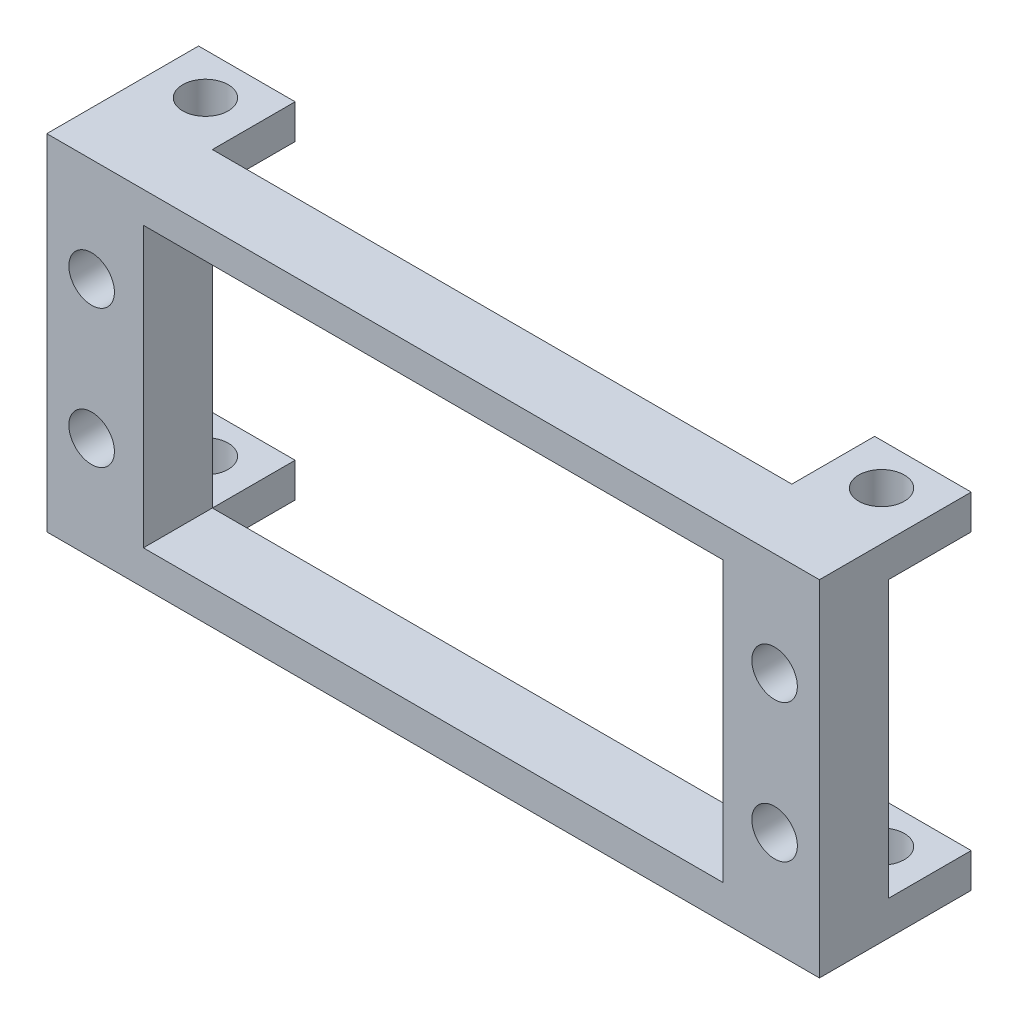
ISO-10303-21;
HEADER;
FILE_DESCRIPTION(('STEP AP214'),'2;1');
FILE_NAME('part.step','',(''),(''),'','','');
FILE_SCHEMA(('AUTOMOTIVE_DESIGN { 1 0 10303 214 1 1 1 1 }'));
ENDSEC;
DATA;
#1=APPLICATION_CONTEXT('core data for automotive mechanical design processes');
#2=APPLICATION_PROTOCOL_DEFINITION('international standard','automotive_design',2000,#1);
#3=PRODUCT_CONTEXT('',#1,'mechanical');
#4=PRODUCT('Part','Part','',(#3));
#5=PRODUCT_RELATED_PRODUCT_CATEGORY('part','',(#4));
#6=PRODUCT_DEFINITION_FORMATION('','',#4);
#7=PRODUCT_DEFINITION_CONTEXT('part definition',#1,'design');
#8=PRODUCT_DEFINITION('design','',#6,#7);
#9=PRODUCT_DEFINITION_SHAPE('','',#8);
#10=(LENGTH_UNIT() NAMED_UNIT(*) SI_UNIT(.MILLI.,.METRE.));
#11=(NAMED_UNIT(*) PLANE_ANGLE_UNIT() SI_UNIT($,.RADIAN.));
#12=(NAMED_UNIT(*) SI_UNIT($,.STERADIAN.) SOLID_ANGLE_UNIT());
#13=UNCERTAINTY_MEASURE_WITH_UNIT(LENGTH_MEASURE(1.E-05),#10,'distance_accuracy_value','');
#14=(GEOMETRIC_REPRESENTATION_CONTEXT(3) GLOBAL_UNCERTAINTY_ASSIGNED_CONTEXT((#13)) GLOBAL_UNIT_ASSIGNED_CONTEXT((#10,
#11,#12)) REPRESENTATION_CONTEXT('',''));
#15=CARTESIAN_POINT('',(0.,0.,0.));
#16=DIRECTION('',(0.,0.,1.));
#17=DIRECTION('',(1.,0.,0.));
#18=AXIS2_PLACEMENT_3D('',#15,#16,#17);
#19=CARTESIAN_POINT('',(-56.,25.,0.));
#20=DIRECTION('',(0.,0.,-1.));
#21=DIRECTION('',(-1.,0.,0.));
#22=AXIS2_PLACEMENT_3D('',#19,#20,#21);
#23=PLANE('',#22);
#24=DIRECTION('',(-1.,0.,0.));
#25=VECTOR('',#24,1.);
#26=CARTESIAN_POINT('',(-49.,22.75,0.));
#27=LINE('',#26,#25);
#28=CARTESIAN_POINT('',(-7.,22.75,0.));
#29=VERTEX_POINT('',#28);
#30=CARTESIAN_POINT('',(-49.,22.75,0.));
#31=VERTEX_POINT('',#30);
#32=EDGE_CURVE('E290',#29,#31,#27,.T.);
#33=ORIENTED_EDGE('',*,*,#32,.T.);
#34=DIRECTION('',(0.,-1.,0.));
#35=VECTOR('',#34,1.);
#36=CARTESIAN_POINT('',(-49.,25.,0.));
#37=LINE('',#36,#35);
#38=CARTESIAN_POINT('',(-49.,25.,0.));
#39=VERTEX_POINT('',#38);
#40=EDGE_CURVE('E56',#39,#31,#37,.T.);
#41=ORIENTED_EDGE('',*,*,#40,.F.);
#42=DIRECTION('',(-1.,0.,0.));
#43=VECTOR('',#42,1.);
#44=CARTESIAN_POINT('',(-56.,25.,0.));
#45=LINE('',#44,#43);
#46=CARTESIAN_POINT('',(-7.,25.,0.));
#47=VERTEX_POINT('',#46);
#48=EDGE_CURVE('E304',#47,#39,#45,.T.);
#49=ORIENTED_EDGE('',*,*,#48,.F.);
#50=DIRECTION('',(0.,1.,0.));
#51=VECTOR('',#50,1.);
#52=CARTESIAN_POINT('',(-7.,25.,0.));
#53=LINE('',#52,#51);
#54=EDGE_CURVE('E11',#29,#47,#53,.T.);
#55=ORIENTED_EDGE('',*,*,#54,.F.);
#56=EDGE_LOOP('',(#33,#41,#49,#55));
#57=FACE_BOUND('',#56,.T.);
#58=ADVANCED_FACE('F31',(#57),#23,.T.);
#59=CARTESIAN_POINT('',(-52.75,7.5,0.));
#60=DIRECTION('',(0.,0.,1.));
#61=DIRECTION('',(1.,0.,0.));
#62=AXIS2_PLACEMENT_3D('',#59,#60,#61);
#63=CIRCLE('',#62,1.64999999999999);
#64=CARTESIAN_POINT('',(-51.1,7.5,0.));
#65=VERTEX_POINT('',#64);
#66=EDGE_CURVE('E377',#65,#65,#63,.T.);
#67=ORIENTED_EDGE('',*,*,#66,.T.);
#68=EDGE_LOOP('',(#67));
#69=FACE_BOUND('',#68,.T.);
#70=CARTESIAN_POINT('',(-52.75,17.5,0.));
#71=DIRECTION('',(0.,0.,1.));
#72=DIRECTION('',(1.,0.,0.));
#73=AXIS2_PLACEMENT_3D('',#70,#71,#72);
#74=CIRCLE('',#73,1.64999999999999);
#75=CARTESIAN_POINT('',(-51.1,17.5,0.));
#76=VERTEX_POINT('',#75);
#77=EDGE_CURVE('E283',#76,#76,#74,.T.);
#78=ORIENTED_EDGE('',*,*,#77,.T.);
#79=EDGE_LOOP('',(#78));
#80=FACE_BOUND('',#79,.T.);
#81=DIRECTION('',(0.,-1.,0.));
#82=VECTOR('',#81,1.);
#83=CARTESIAN_POINT('',(-56.,0.,0.));
#84=LINE('',#83,#82);
#85=CARTESIAN_POINT('',(-56.,22.5,0.));
#86=VERTEX_POINT('',#85);
#87=CARTESIAN_POINT('',(-56.,2.5,0.));
#88=VERTEX_POINT('',#87);
#89=EDGE_CURVE('E48',#86,#88,#84,.T.);
#90=ORIENTED_EDGE('',*,*,#89,.F.);
#91=DIRECTION('',(-1.,0.,0.));
#92=VECTOR('',#91,1.);
#93=CARTESIAN_POINT('',(-56.,22.5,0.));
#94=LINE('',#93,#92);
#95=CARTESIAN_POINT('',(-49.,22.5,0.));
#96=VERTEX_POINT('',#95);
#97=EDGE_CURVE('E193',#96,#86,#94,.T.);
#98=ORIENTED_EDGE('',*,*,#97,.F.);
#99=DIRECTION('',(0.,-1.,0.));
#100=VECTOR('',#99,1.);
#101=CARTESIAN_POINT('',(-49.,2.49999999999999,0.));
#102=LINE('',#101,#100);
#103=CARTESIAN_POINT('',(-49.,2.5,0.));
#104=VERTEX_POINT('',#103);
#105=EDGE_CURVE('E292',#96,#104,#102,.T.);
#106=ORIENTED_EDGE('',*,*,#105,.T.);
#107=DIRECTION('',(1.,0.,0.));
#108=VECTOR('',#107,1.);
#109=CARTESIAN_POINT('',(-56.,2.5,0.));
#110=LINE('',#109,#108);
#111=EDGE_CURVE('E209',#88,#104,#110,.T.);
#112=ORIENTED_EDGE('',*,*,#111,.F.);
#113=EDGE_LOOP('',(#90,#98,#106,#112));
#114=FACE_BOUND('',#113,.T.);
#115=ADVANCED_FACE('F385',(#69,#80,#114),#23,.T.);
#116=DIRECTION('',(1.,0.,0.));
#117=VECTOR('',#116,1.);
#118=CARTESIAN_POINT('',(-56.,0.,0.));
#119=LINE('',#118,#117);
#120=CARTESIAN_POINT('',(-49.,0.,0.));
#121=VERTEX_POINT('',#120);
#122=CARTESIAN_POINT('',(-7.,0.,0.));
#123=VERTEX_POINT('',#122);
#124=EDGE_CURVE('E305',#121,#123,#119,.T.);
#125=ORIENTED_EDGE('',*,*,#124,.F.);
#126=DIRECTION('',(0.,-1.,0.));
#127=VECTOR('',#126,1.);
#128=CARTESIAN_POINT('',(-49.,0.,0.));
#129=LINE('',#128,#127);
#130=EDGE_CURVE('E214',#104,#121,#129,.T.);
#131=ORIENTED_EDGE('',*,*,#130,.F.);
#132=DIRECTION('',(1.,0.,0.));
#133=VECTOR('',#132,1.);
#134=CARTESIAN_POINT('',(-7.,2.5,0.));
#135=LINE('',#134,#133);
#136=CARTESIAN_POINT('',(-7.,2.5,0.));
#137=VERTEX_POINT('',#136);
#138=EDGE_CURVE('E317',#104,#137,#135,.T.);
#139=ORIENTED_EDGE('',*,*,#138,.T.);
#140=DIRECTION('',(0.,1.,0.));
#141=VECTOR('',#140,1.);
#142=CARTESIAN_POINT('',(-7.,0.,0.));
#143=LINE('',#142,#141);
#144=EDGE_CURVE('E233',#123,#137,#143,.T.);
#145=ORIENTED_EDGE('',*,*,#144,.F.);
#146=EDGE_LOOP('',(#125,#131,#139,#145));
#147=FACE_BOUND('',#146,.T.);
#148=ADVANCED_FACE('F351',(#147),#23,.T.);
#149=CARTESIAN_POINT('',(-3.25,17.5,0.));
#150=DIRECTION('',(0.,0.,1.));
#151=DIRECTION('',(1.,0.,0.));
#152=AXIS2_PLACEMENT_3D('',#149,#150,#151);
#153=CIRCLE('',#152,1.65);
#154=CARTESIAN_POINT('',(-1.6,17.5,0.));
#155=VERTEX_POINT('',#154);
#156=EDGE_CURVE('E365',#155,#155,#153,.T.);
#157=ORIENTED_EDGE('',*,*,#156,.T.);
#158=EDGE_LOOP('',(#157));
#159=FACE_BOUND('',#158,.T.);
#160=CARTESIAN_POINT('',(-3.25,7.5,0.));
#161=DIRECTION('',(0.,0.,1.));
#162=DIRECTION('',(1.,0.,0.));
#163=AXIS2_PLACEMENT_3D('',#160,#161,#162);
#164=CIRCLE('',#163,1.65);
#165=CARTESIAN_POINT('',(-1.6,7.5,0.));
#166=VERTEX_POINT('',#165);
#167=EDGE_CURVE('E371',#166,#166,#164,.T.);
#168=ORIENTED_EDGE('',*,*,#167,.T.);
#169=EDGE_LOOP('',(#168));
#170=FACE_BOUND('',#169,.T.);
#171=DIRECTION('',(0.,1.,0.));
#172=VECTOR('',#171,1.);
#173=CARTESIAN_POINT('',(0.,0.,0.));
#174=LINE('',#173,#172);
#175=CARTESIAN_POINT('',(0.,2.5,0.));
#176=VERTEX_POINT('',#175);
#177=CARTESIAN_POINT('',(0.,22.5,0.));
#178=VERTEX_POINT('',#177);
#179=EDGE_CURVE('E302',#176,#178,#174,.T.);
#180=ORIENTED_EDGE('',*,*,#179,.F.);
#181=DIRECTION('',(1.,0.,0.));
#182=VECTOR('',#181,1.);
#183=CARTESIAN_POINT('',(0.,2.5,0.));
#184=LINE('',#183,#182);
#185=EDGE_CURVE('E238',#137,#176,#184,.T.);
#186=ORIENTED_EDGE('',*,*,#185,.F.);
#187=DIRECTION('',(0.,1.,0.));
#188=VECTOR('',#187,1.);
#189=CARTESIAN_POINT('',(-7.,22.75,0.));
#190=LINE('',#189,#188);
#191=CARTESIAN_POINT('',(-7.,22.5,0.));
#192=VERTEX_POINT('',#191);
#193=EDGE_CURVE('E313',#137,#192,#190,.T.);
#194=ORIENTED_EDGE('',*,*,#193,.T.);
#195=DIRECTION('',(-1.,0.,0.));
#196=VECTOR('',#195,1.);
#197=CARTESIAN_POINT('',(0.,22.5,0.));
#198=LINE('',#197,#196);
#199=EDGE_CURVE('E255',#178,#192,#198,.T.);
#200=ORIENTED_EDGE('',*,*,#199,.F.);
#201=EDGE_LOOP('',(#180,#186,#194,#200));
#202=FACE_BOUND('',#201,.T.);
#203=ADVANCED_FACE('F398',(#159,#170,#202),#23,.T.);
#204=CARTESIAN_POINT('',(-56.,25.,5.));
#205=DIRECTION('',(0.,0.,-1.));
#206=DIRECTION('',(-1.,0.,0.));
#207=AXIS2_PLACEMENT_3D('',#204,#205,#206);
#208=PLANE('',#207);
#209=CARTESIAN_POINT('',(-52.75,17.5,5.));
#210=DIRECTION('',(0.,0.,1.));
#211=DIRECTION('',(1.,0.,0.));
#212=AXIS2_PLACEMENT_3D('',#209,#210,#211);
#213=CIRCLE('',#212,1.64999999999999);
#214=CARTESIAN_POINT('',(-51.1,17.5,5.));
#215=VERTEX_POINT('',#214);
#216=EDGE_CURVE('E380',#215,#215,#213,.T.);
#217=ORIENTED_EDGE('',*,*,#216,.F.);
#218=EDGE_LOOP('',(#217));
#219=FACE_BOUND('',#218,.T.);
#220=CARTESIAN_POINT('',(-52.75,7.5,5.));
#221=DIRECTION('',(0.,0.,1.));
#222=DIRECTION('',(1.,0.,0.));
#223=AXIS2_PLACEMENT_3D('',#220,#221,#222);
#224=CIRCLE('',#223,1.64999999999999);
#225=CARTESIAN_POINT('',(-51.1,7.5,5.));
#226=VERTEX_POINT('',#225);
#227=EDGE_CURVE('E374',#226,#226,#224,.T.);
#228=ORIENTED_EDGE('',*,*,#227,.F.);
#229=EDGE_LOOP('',(#228));
#230=FACE_BOUND('',#229,.T.);
#231=CARTESIAN_POINT('',(-3.25,7.5,5.));
#232=DIRECTION('',(0.,0.,1.));
#233=DIRECTION('',(1.,0.,0.));
#234=AXIS2_PLACEMENT_3D('',#231,#232,#233);
#235=CIRCLE('',#234,1.64999999999999);
#236=CARTESIAN_POINT('',(-1.60000000000001,7.5,5.));
#237=VERTEX_POINT('',#236);
#238=EDGE_CURVE('E368',#237,#237,#235,.T.);
#239=ORIENTED_EDGE('',*,*,#238,.F.);
#240=EDGE_LOOP('',(#239));
#241=FACE_BOUND('',#240,.T.);
#242=CARTESIAN_POINT('',(-3.25,17.5,5.));
#243=DIRECTION('',(0.,0.,1.));
#244=DIRECTION('',(1.,0.,0.));
#245=AXIS2_PLACEMENT_3D('',#242,#243,#244);
#246=CIRCLE('',#245,1.64999999999999);
#247=CARTESIAN_POINT('',(-1.60000000000001,17.5,5.));
#248=VERTEX_POINT('',#247);
#249=EDGE_CURVE('E293',#248,#248,#246,.T.);
#250=ORIENTED_EDGE('',*,*,#249,.F.);
#251=EDGE_LOOP('',(#250));
#252=FACE_BOUND('',#251,.T.);
#253=DIRECTION('',(0.,-1.,0.));
#254=VECTOR('',#253,1.);
#255=CARTESIAN_POINT('',(-56.,0.,5.));
#256=LINE('',#255,#254);
#257=CARTESIAN_POINT('',(-56.,25.,5.));
#258=VERTEX_POINT('',#257);
#259=CARTESIAN_POINT('',(-56.,0.,5.));
#260=VERTEX_POINT('',#259);
#261=EDGE_CURVE('E174',#258,#260,#256,.T.);
#262=ORIENTED_EDGE('',*,*,#261,.T.);
#263=DIRECTION('',(1.,0.,0.));
#264=VECTOR('',#263,1.);
#265=CARTESIAN_POINT('',(-56.,0.,5.));
#266=LINE('',#265,#264);
#267=CARTESIAN_POINT('',(0.,0.,5.));
#268=VERTEX_POINT('',#267);
#269=EDGE_CURVE('E331',#260,#268,#266,.T.);
#270=ORIENTED_EDGE('',*,*,#269,.T.);
#271=DIRECTION('',(0.,1.,0.));
#272=VECTOR('',#271,1.);
#273=CARTESIAN_POINT('',(0.,0.,5.));
#274=LINE('',#273,#272);
#275=CARTESIAN_POINT('',(0.,25.,5.));
#276=VERTEX_POINT('',#275);
#277=EDGE_CURVE('E333',#268,#276,#274,.T.);
#278=ORIENTED_EDGE('',*,*,#277,.T.);
#279=DIRECTION('',(-1.,0.,0.));
#280=VECTOR('',#279,1.);
#281=CARTESIAN_POINT('',(-56.,25.,5.));
#282=LINE('',#281,#280);
#283=EDGE_CURVE('E178',#276,#258,#282,.T.);
#284=ORIENTED_EDGE('',*,*,#283,.T.);
#285=EDGE_LOOP('',(#262,#270,#278,#284));
#286=FACE_BOUND('',#285,.T.);
#287=DIRECTION('',(-1.,0.,0.));
#288=VECTOR('',#287,1.);
#289=CARTESIAN_POINT('',(-49.,22.75,5.));
#290=LINE('',#289,#288);
#291=CARTESIAN_POINT('',(-7.,22.75,5.));
#292=VERTEX_POINT('',#291);
#293=CARTESIAN_POINT('',(-49.,22.75,5.));
#294=VERTEX_POINT('',#293);
#295=EDGE_CURVE('E316',#292,#294,#290,.T.);
#296=ORIENTED_EDGE('',*,*,#295,.F.);
#297=DIRECTION('',(0.,1.,0.));
#298=VECTOR('',#297,1.);
#299=CARTESIAN_POINT('',(-7.,22.75,5.));
#300=LINE('',#299,#298);
#301=CARTESIAN_POINT('',(-7.,2.5,5.));
#302=VERTEX_POINT('',#301);
#303=EDGE_CURVE('E300',#302,#292,#300,.T.);
#304=ORIENTED_EDGE('',*,*,#303,.F.);
#305=DIRECTION('',(1.,0.,0.));
#306=VECTOR('',#305,1.);
#307=CARTESIAN_POINT('',(-7.,2.5,5.));
#308=LINE('',#307,#306);
#309=CARTESIAN_POINT('',(-49.,2.49999999999999,5.));
#310=VERTEX_POINT('',#309);
#311=EDGE_CURVE('E357',#310,#302,#308,.T.);
#312=ORIENTED_EDGE('',*,*,#311,.F.);
#313=DIRECTION('',(0.,-1.,0.));
#314=VECTOR('',#313,1.);
#315=CARTESIAN_POINT('',(-49.,2.49999999999999,5.));
#316=LINE('',#315,#314);
#317=EDGE_CURVE('E360',#294,#310,#316,.T.);
#318=ORIENTED_EDGE('',*,*,#317,.F.);
#319=EDGE_LOOP('',(#296,#304,#312,#318));
#320=FACE_BOUND('',#319,.T.);
#321=ADVANCED_FACE('F395',(#219,#230,#241,#252,#286,#320),#208,.F.);
#322=CARTESIAN_POINT('',(-56.,0.,5.));
#323=DIRECTION('',(1.,0.,0.));
#324=DIRECTION('',(0.,0.,-1.));
#325=AXIS2_PLACEMENT_3D('',#322,#323,#324);
#326=PLANE('',#325);
#327=DIRECTION('',(0.,0.,-1.));
#328=VECTOR('',#327,1.);
#329=CARTESIAN_POINT('',(-56.,25.,5.));
#330=LINE('',#329,#328);
#331=CARTESIAN_POINT('',(-56.,25.,-6.));
#332=VERTEX_POINT('',#331);
#333=EDGE_CURVE('E167',#258,#332,#330,.T.);
#334=ORIENTED_EDGE('',*,*,#333,.T.);
#335=DIRECTION('',(0.,1.,0.));
#336=VECTOR('',#335,1.);
#337=CARTESIAN_POINT('',(-56.,25.,-6.));
#338=LINE('',#337,#336);
#339=CARTESIAN_POINT('',(-56.,22.5,-6.));
#340=VERTEX_POINT('',#339);
#341=EDGE_CURVE('E171',#340,#332,#338,.T.);
#342=ORIENTED_EDGE('',*,*,#341,.F.);
#343=DIRECTION('',(0.,0.,1.));
#344=VECTOR('',#343,1.);
#345=CARTESIAN_POINT('',(-56.,22.5,-6.));
#346=LINE('',#345,#344);
#347=EDGE_CURVE('E202',#340,#86,#346,.T.);
#348=ORIENTED_EDGE('',*,*,#347,.T.);
#349=ORIENTED_EDGE('',*,*,#89,.T.);
#350=DIRECTION('',(0.,0.,1.));
#351=VECTOR('',#350,1.);
#352=CARTESIAN_POINT('',(-56.,2.5,-6.));
#353=LINE('',#352,#351);
#354=CARTESIAN_POINT('',(-56.,2.5,-6.));
#355=VERTEX_POINT('',#354);
#356=EDGE_CURVE('E230',#355,#88,#353,.T.);
#357=ORIENTED_EDGE('',*,*,#356,.F.);
#358=DIRECTION('',(0.,1.,0.));
#359=VECTOR('',#358,1.);
#360=CARTESIAN_POINT('',(-56.,0.,-6.));
#361=LINE('',#360,#359);
#362=CARTESIAN_POINT('',(-56.,0.,-6.));
#363=VERTEX_POINT('',#362);
#364=EDGE_CURVE('E210',#363,#355,#361,.T.);
#365=ORIENTED_EDGE('',*,*,#364,.F.);
#366=DIRECTION('',(0.,0.,-1.));
#367=VECTOR('',#366,1.);
#368=CARTESIAN_POINT('',(-56.,0.,5.));
#369=LINE('',#368,#367);
#370=EDGE_CURVE('E40',#260,#363,#369,.T.);
#371=ORIENTED_EDGE('',*,*,#370,.F.);
#372=ORIENTED_EDGE('',*,*,#261,.F.);
#373=EDGE_LOOP('',(#334,#342,#348,#349,#357,#365,#371,#372));
#374=FACE_BOUND('',#373,.T.);
#375=ADVANCED_FACE('F33',(#374),#326,.F.);
#376=CARTESIAN_POINT('',(-56.,0.,5.));
#377=DIRECTION('',(0.,1.,0.));
#378=DIRECTION('',(0.,0.,1.));
#379=AXIS2_PLACEMENT_3D('',#376,#377,#378);
#380=PLANE('',#379);
#381=CARTESIAN_POINT('',(-3.5,0.,-3.));
#382=DIRECTION('',(0.,-1.,0.));
#383=DIRECTION('',(0.,0.,-1.));
#384=AXIS2_PLACEMENT_3D('',#381,#382,#383);
#385=CIRCLE('',#384,1.64999999999999);
#386=CARTESIAN_POINT('',(-3.5,0.,-4.64999999999999));
#387=VERTEX_POINT('',#386);
#388=EDGE_CURVE('E444',#387,#387,#385,.T.);
#389=ORIENTED_EDGE('',*,*,#388,.F.);
#390=EDGE_LOOP('',(#389));
#391=FACE_BOUND('',#390,.T.);
#392=CARTESIAN_POINT('',(-52.5,0.,-3.));
#393=DIRECTION('',(0.,-1.,0.));
#394=DIRECTION('',(0.,0.,-1.));
#395=AXIS2_PLACEMENT_3D('',#392,#393,#394);
#396=CIRCLE('',#395,1.64999999999999);
#397=CARTESIAN_POINT('',(-52.5,0.,-4.64999999999999));
#398=VERTEX_POINT('',#397);
#399=EDGE_CURVE('E447',#398,#398,#396,.T.);
#400=ORIENTED_EDGE('',*,*,#399,.F.);
#401=EDGE_LOOP('',(#400));
#402=FACE_BOUND('',#401,.T.);
#403=ORIENTED_EDGE('',*,*,#370,.T.);
#404=DIRECTION('',(-1.,0.,0.));
#405=VECTOR('',#404,1.);
#406=CARTESIAN_POINT('',(-56.,0.,-6.));
#407=LINE('',#406,#405);
#408=CARTESIAN_POINT('',(-49.,0.,-6.));
#409=VERTEX_POINT('',#408);
#410=EDGE_CURVE('E218',#409,#363,#407,.T.);
#411=ORIENTED_EDGE('',*,*,#410,.F.);
#412=DIRECTION('',(0.,0.,1.));
#413=VECTOR('',#412,1.);
#414=CARTESIAN_POINT('',(-49.,0.,-6.));
#415=LINE('',#414,#413);
#416=EDGE_CURVE('E221',#409,#121,#415,.T.);
#417=ORIENTED_EDGE('',*,*,#416,.T.);
#418=ORIENTED_EDGE('',*,*,#124,.T.);
#419=DIRECTION('',(0.,0.,1.));
#420=VECTOR('',#419,1.);
#421=CARTESIAN_POINT('',(-7.,0.,-6.));
#422=LINE('',#421,#420);
#423=CARTESIAN_POINT('',(-7.,0.,-6.));
#424=VERTEX_POINT('',#423);
#425=EDGE_CURVE('E252',#424,#123,#422,.T.);
#426=ORIENTED_EDGE('',*,*,#425,.F.);
#427=DIRECTION('',(-1.,0.,0.));
#428=VECTOR('',#427,1.);
#429=CARTESIAN_POINT('',(0.,0.,-6.));
#430=LINE('',#429,#428);
#431=CARTESIAN_POINT('',(0.,0.,-6.));
#432=VERTEX_POINT('',#431);
#433=EDGE_CURVE('E237',#432,#424,#430,.T.);
#434=ORIENTED_EDGE('',*,*,#433,.F.);
#435=DIRECTION('',(0.,0.,-1.));
#436=VECTOR('',#435,1.);
#437=CARTESIAN_POINT('',(0.,0.,5.));
#438=LINE('',#437,#436);
#439=EDGE_CURVE('E737',#268,#432,#438,.T.);
#440=ORIENTED_EDGE('',*,*,#439,.F.);
#441=ORIENTED_EDGE('',*,*,#269,.F.);
#442=EDGE_LOOP('',(#403,#411,#417,#418,#426,#434,#440,#441));
#443=FACE_BOUND('',#442,.T.);
#444=ADVANCED_FACE('F339',(#391,#402,#443),#380,.F.);
#445=CARTESIAN_POINT('',(0.,0.,5.));
#446=DIRECTION('',(-1.,0.,0.));
#447=DIRECTION('',(0.,0.,1.));
#448=AXIS2_PLACEMENT_3D('',#445,#446,#447);
#449=PLANE('',#448);
#450=ORIENTED_EDGE('',*,*,#439,.T.);
#451=DIRECTION('',(0.,-1.,0.));
#452=VECTOR('',#451,1.);
#453=CARTESIAN_POINT('',(0.,0.,-6.));
#454=LINE('',#453,#452);
#455=CARTESIAN_POINT('',(0.,2.5,-6.));
#456=VERTEX_POINT('',#455);
#457=EDGE_CURVE('E234',#456,#432,#454,.T.);
#458=ORIENTED_EDGE('',*,*,#457,.F.);
#459=DIRECTION('',(0.,0.,1.));
#460=VECTOR('',#459,1.);
#461=CARTESIAN_POINT('',(0.,2.5,-6.));
#462=LINE('',#461,#460);
#463=EDGE_CURVE('E244',#456,#176,#462,.T.);
#464=ORIENTED_EDGE('',*,*,#463,.T.);
#465=ORIENTED_EDGE('',*,*,#179,.T.);
#466=DIRECTION('',(0.,0.,1.));
#467=VECTOR('',#466,1.);
#468=CARTESIAN_POINT('',(0.,22.5,-6.));
#469=LINE('',#468,#467);
#470=CARTESIAN_POINT('',(0.,22.5,-6.));
#471=VERTEX_POINT('',#470);
#472=EDGE_CURVE('E278',#471,#178,#469,.T.);
#473=ORIENTED_EDGE('',*,*,#472,.F.);
#474=DIRECTION('',(0.,-1.,0.));
#475=VECTOR('',#474,1.);
#476=CARTESIAN_POINT('',(0.,25.,-6.));
#477=LINE('',#476,#475);
#478=CARTESIAN_POINT('',(0.,25.,-6.));
#479=VERTEX_POINT('',#478);
#480=EDGE_CURVE('E256',#479,#471,#477,.T.);
#481=ORIENTED_EDGE('',*,*,#480,.F.);
#482=DIRECTION('',(0.,0.,-1.));
#483=VECTOR('',#482,1.);
#484=CARTESIAN_POINT('',(0.,25.,5.));
#485=LINE('',#484,#483);
#486=EDGE_CURVE('E177',#276,#479,#485,.T.);
#487=ORIENTED_EDGE('',*,*,#486,.F.);
#488=ORIENTED_EDGE('',*,*,#277,.F.);
#489=EDGE_LOOP('',(#450,#458,#464,#465,#473,#481,#487,#488));
#490=FACE_BOUND('',#489,.T.);
#491=ADVANCED_FACE('F432',(#490),#449,.F.);
#492=CARTESIAN_POINT('',(-56.,25.,5.));
#493=DIRECTION('',(0.,-1.,0.));
#494=DIRECTION('',(0.,0.,-1.));
#495=AXIS2_PLACEMENT_3D('',#492,#493,#494);
#496=PLANE('',#495);
#497=CARTESIAN_POINT('',(-3.5,25.,-3.));
#498=DIRECTION('',(0.,1.,0.));
#499=DIRECTION('',(0.,0.,1.));
#500=AXIS2_PLACEMENT_3D('',#497,#498,#499);
#501=CIRCLE('',#500,1.64999999999999);
#502=CARTESIAN_POINT('',(-3.5,25.,-1.35000000000001));
#503=VERTEX_POINT('',#502);
#504=EDGE_CURVE('E462',#503,#503,#501,.T.);
#505=ORIENTED_EDGE('',*,*,#504,.F.);
#506=EDGE_LOOP('',(#505));
#507=FACE_BOUND('',#506,.T.);
#508=CARTESIAN_POINT('',(-52.5,25.,-3.));
#509=DIRECTION('',(0.,1.,0.));
#510=DIRECTION('',(0.,0.,1.));
#511=AXIS2_PLACEMENT_3D('',#508,#509,#510);
#512=CIRCLE('',#511,1.64999999999999);
#513=CARTESIAN_POINT('',(-52.5,25.,-1.35000000000001));
#514=VERTEX_POINT('',#513);
#515=EDGE_CURVE('E456',#514,#514,#512,.T.);
#516=ORIENTED_EDGE('',*,*,#515,.F.);
#517=EDGE_LOOP('',(#516));
#518=FACE_BOUND('',#517,.T.);
#519=ORIENTED_EDGE('',*,*,#486,.T.);
#520=DIRECTION('',(1.,0.,0.));
#521=VECTOR('',#520,1.);
#522=CARTESIAN_POINT('',(0.,25.,-6.));
#523=LINE('',#522,#521);
#524=CARTESIAN_POINT('',(-7.,25.,-6.));
#525=VERTEX_POINT('',#524);
#526=EDGE_CURVE('E263',#525,#479,#523,.T.);
#527=ORIENTED_EDGE('',*,*,#526,.F.);
#528=DIRECTION('',(0.,0.,1.));
#529=VECTOR('',#528,1.);
#530=CARTESIAN_POINT('',(-7.,25.,-6.));
#531=LINE('',#530,#529);
#532=EDGE_CURVE('E266',#525,#47,#531,.T.);
#533=ORIENTED_EDGE('',*,*,#532,.T.);
#534=ORIENTED_EDGE('',*,*,#48,.T.);
#535=DIRECTION('',(0.,0.,1.));
#536=VECTOR('',#535,1.);
#537=CARTESIAN_POINT('',(-49.,25.,-6.));
#538=LINE('',#537,#536);
#539=CARTESIAN_POINT('',(-49.,25.,-6.));
#540=VERTEX_POINT('',#539);
#541=EDGE_CURVE('E184',#540,#39,#538,.T.);
#542=ORIENTED_EDGE('',*,*,#541,.F.);
#543=DIRECTION('',(1.,0.,0.));
#544=VECTOR('',#543,1.);
#545=CARTESIAN_POINT('',(-56.,25.,-6.));
#546=LINE('',#545,#544);
#547=EDGE_CURVE('E181',#332,#540,#546,.T.);
#548=ORIENTED_EDGE('',*,*,#547,.F.);
#549=ORIENTED_EDGE('',*,*,#333,.F.);
#550=ORIENTED_EDGE('',*,*,#283,.F.);
#551=EDGE_LOOP('',(#519,#527,#533,#534,#542,#548,#549,#550));
#552=FACE_BOUND('',#551,.T.);
#553=ADVANCED_FACE('F182',(#507,#518,#552),#496,.F.);
#554=CARTESIAN_POINT('',(-49.,22.75,5.));
#555=DIRECTION('',(0.,-1.,0.));
#556=DIRECTION('',(0.,0.,-1.));
#557=AXIS2_PLACEMENT_3D('',#554,#555,#556);
#558=PLANE('',#557);
#559=ORIENTED_EDGE('',*,*,#32,.F.);
#560=DIRECTION('',(0.,0.,-1.));
#561=VECTOR('',#560,1.);
#562=CARTESIAN_POINT('',(-7.,22.75,5.));
#563=LINE('',#562,#561);
#564=EDGE_CURVE('E296',#292,#29,#563,.T.);
#565=ORIENTED_EDGE('',*,*,#564,.F.);
#566=ORIENTED_EDGE('',*,*,#295,.T.);
#567=DIRECTION('',(0.,0.,-1.));
#568=VECTOR('',#567,1.);
#569=CARTESIAN_POINT('',(-49.,22.75,5.));
#570=LINE('',#569,#568);
#571=EDGE_CURVE('E328',#294,#31,#570,.T.);
#572=ORIENTED_EDGE('',*,*,#571,.T.);
#573=EDGE_LOOP('',(#559,#565,#566,#572));
#574=FACE_BOUND('',#573,.T.);
#575=ADVANCED_FACE('F415',(#574),#558,.T.);
#576=CARTESIAN_POINT('',(-49.,2.49999999999999,5.));
#577=DIRECTION('',(1.,0.,0.));
#578=DIRECTION('',(0.,0.,-1.));
#579=AXIS2_PLACEMENT_3D('',#576,#577,#578);
#580=PLANE('',#579);
#581=ORIENTED_EDGE('',*,*,#105,.F.);
#582=DIRECTION('',(0.,0.,1.));
#583=VECTOR('',#582,1.);
#584=CARTESIAN_POINT('',(-49.,22.5,-6.));
#585=LINE('',#584,#583);
#586=CARTESIAN_POINT('',(-49.,22.5,-6.));
#587=VERTEX_POINT('',#586);
#588=EDGE_CURVE('E205',#587,#96,#585,.T.);
#589=ORIENTED_EDGE('',*,*,#588,.F.);
#590=DIRECTION('',(0.,-1.,0.));
#591=VECTOR('',#590,1.);
#592=CARTESIAN_POINT('',(-49.,25.,-6.));
#593=LINE('',#592,#591);
#594=EDGE_CURVE('E187',#540,#587,#593,.T.);
#595=ORIENTED_EDGE('',*,*,#594,.F.);
#596=ORIENTED_EDGE('',*,*,#541,.T.);
#597=ORIENTED_EDGE('',*,*,#40,.T.);
#598=ORIENTED_EDGE('',*,*,#571,.F.);
#599=ORIENTED_EDGE('',*,*,#317,.T.);
#600=DIRECTION('',(0.,0.,-1.));
#601=VECTOR('',#600,1.);
#602=CARTESIAN_POINT('',(-49.,2.49999999999999,5.));
#603=LINE('',#602,#601);
#604=EDGE_CURVE('E325',#310,#104,#603,.T.);
#605=ORIENTED_EDGE('',*,*,#604,.T.);
#606=EDGE_LOOP('',(#581,#589,#595,#596,#597,#598,#599,#605));
#607=FACE_BOUND('',#606,.T.);
#608=ADVANCED_FACE('F417',(#607),#580,.T.);
#609=CARTESIAN_POINT('',(-7.,2.5,5.));
#610=DIRECTION('',(0.,1.,0.));
#611=DIRECTION('',(-1.,0.,0.));
#612=AXIS2_PLACEMENT_3D('',#609,#610,#611);
#613=PLANE('',#612);
#614=ORIENTED_EDGE('',*,*,#138,.F.);
#615=ORIENTED_EDGE('',*,*,#604,.F.);
#616=ORIENTED_EDGE('',*,*,#311,.T.);
#617=DIRECTION('',(0.,0.,-1.));
#618=VECTOR('',#617,1.);
#619=CARTESIAN_POINT('',(-7.,2.5,5.));
#620=LINE('',#619,#618);
#621=EDGE_CURVE('E299',#302,#137,#620,.T.);
#622=ORIENTED_EDGE('',*,*,#621,.T.);
#623=EDGE_LOOP('',(#614,#615,#616,#622));
#624=FACE_BOUND('',#623,.T.);
#625=ADVANCED_FACE('F530',(#624),#613,.T.);
#626=CARTESIAN_POINT('',(-7.,22.75,5.));
#627=DIRECTION('',(-1.,0.,0.));
#628=DIRECTION('',(0.,-1.,0.));
#629=AXIS2_PLACEMENT_3D('',#626,#627,#628);
#630=PLANE('',#629);
#631=ORIENTED_EDGE('',*,*,#193,.F.);
#632=ORIENTED_EDGE('',*,*,#621,.F.);
#633=ORIENTED_EDGE('',*,*,#303,.T.);
#634=ORIENTED_EDGE('',*,*,#564,.T.);
#635=ORIENTED_EDGE('',*,*,#54,.T.);
#636=ORIENTED_EDGE('',*,*,#532,.F.);
#637=DIRECTION('',(0.,1.,0.));
#638=VECTOR('',#637,1.);
#639=CARTESIAN_POINT('',(-7.,25.,-6.));
#640=LINE('',#639,#638);
#641=CARTESIAN_POINT('',(-7.,22.5,-6.));
#642=VERTEX_POINT('',#641);
#643=EDGE_CURVE('E261',#642,#525,#640,.T.);
#644=ORIENTED_EDGE('',*,*,#643,.F.);
#645=DIRECTION('',(0.,0.,1.));
#646=VECTOR('',#645,1.);
#647=CARTESIAN_POINT('',(-7.,22.5,-6.));
#648=LINE('',#647,#646);
#649=EDGE_CURVE('E275',#642,#192,#648,.T.);
#650=ORIENTED_EDGE('',*,*,#649,.T.);
#651=EDGE_LOOP('',(#631,#632,#633,#634,#635,#636,#644,#650));
#652=FACE_BOUND('',#651,.T.);
#653=ADVANCED_FACE('F526',(#652),#630,.T.);
#654=CARTESIAN_POINT('',(-3.25,17.5,5.));
#655=DIRECTION('',(0.,0.,1.));
#656=DIRECTION('',(1.,0.,0.));
#657=AXIS2_PLACEMENT_3D('',#654,#655,#656);
#658=CYLINDRICAL_SURFACE('',#657,1.64999999999999);
#659=ORIENTED_EDGE('',*,*,#156,.F.);
#660=EDGE_LOOP('',(#659));
#661=FACE_BOUND('',#660,.T.);
#662=ORIENTED_EDGE('',*,*,#249,.T.);
#663=EDGE_LOOP('',(#662));
#664=FACE_BOUND('',#663,.T.);
#665=ADVANCED_FACE('F522',(#661,#664),#658,.F.);
#666=CARTESIAN_POINT('',(-3.25,7.5,5.));
#667=DIRECTION('',(0.,0.,1.));
#668=DIRECTION('',(1.,0.,0.));
#669=AXIS2_PLACEMENT_3D('',#666,#667,#668);
#670=CYLINDRICAL_SURFACE('',#669,1.64999999999999);
#671=ORIENTED_EDGE('',*,*,#167,.F.);
#672=EDGE_LOOP('',(#671));
#673=FACE_BOUND('',#672,.T.);
#674=ORIENTED_EDGE('',*,*,#238,.T.);
#675=EDGE_LOOP('',(#674));
#676=FACE_BOUND('',#675,.T.);
#677=ADVANCED_FACE('F518',(#673,#676),#670,.F.);
#678=CARTESIAN_POINT('',(-52.75,7.5,5.));
#679=DIRECTION('',(0.,0.,1.));
#680=DIRECTION('',(1.,0.,0.));
#681=AXIS2_PLACEMENT_3D('',#678,#679,#680);
#682=CYLINDRICAL_SURFACE('',#681,1.64999999999999);
#683=ORIENTED_EDGE('',*,*,#66,.F.);
#684=EDGE_LOOP('',(#683));
#685=FACE_BOUND('',#684,.T.);
#686=ORIENTED_EDGE('',*,*,#227,.T.);
#687=EDGE_LOOP('',(#686));
#688=FACE_BOUND('',#687,.T.);
#689=ADVANCED_FACE('F391',(#685,#688),#682,.F.);
#690=CARTESIAN_POINT('',(-52.75,17.5,5.));
#691=DIRECTION('',(0.,0.,1.));
#692=DIRECTION('',(1.,0.,0.));
#693=AXIS2_PLACEMENT_3D('',#690,#691,#692);
#694=CYLINDRICAL_SURFACE('',#693,1.64999999999999);
#695=ORIENTED_EDGE('',*,*,#77,.F.);
#696=EDGE_LOOP('',(#695));
#697=FACE_BOUND('',#696,.T.);
#698=ORIENTED_EDGE('',*,*,#216,.T.);
#699=EDGE_LOOP('',(#698));
#700=FACE_BOUND('',#699,.T.);
#701=ADVANCED_FACE('F387',(#697,#700),#694,.F.);
#702=CARTESIAN_POINT('',(0.,22.5,-6.));
#703=DIRECTION('',(0.,1.,0.));
#704=DIRECTION('',(0.,0.,1.));
#705=AXIS2_PLACEMENT_3D('',#702,#703,#704);
#706=PLANE('',#705);
#707=CARTESIAN_POINT('',(-3.5,22.5,-3.));
#708=DIRECTION('',(0.,1.,0.));
#709=DIRECTION('',(0.,0.,1.));
#710=AXIS2_PLACEMENT_3D('',#707,#708,#709);
#711=CIRCLE('',#710,1.64999999999999);
#712=CARTESIAN_POINT('',(-3.5,22.5,-1.35000000000001));
#713=VERTEX_POINT('',#712);
#714=EDGE_CURVE('E459',#713,#713,#711,.T.);
#715=ORIENTED_EDGE('',*,*,#714,.T.);
#716=EDGE_LOOP('',(#715));
#717=FACE_BOUND('',#716,.T.);
#718=ORIENTED_EDGE('',*,*,#199,.T.);
#719=ORIENTED_EDGE('',*,*,#649,.F.);
#720=DIRECTION('',(-1.,0.,0.));
#721=VECTOR('',#720,1.);
#722=CARTESIAN_POINT('',(0.,22.5,-6.));
#723=LINE('',#722,#721);
#724=EDGE_CURVE('E259',#471,#642,#723,.T.);
#725=ORIENTED_EDGE('',*,*,#724,.F.);
#726=ORIENTED_EDGE('',*,*,#472,.T.);
#727=EDGE_LOOP('',(#718,#719,#725,#726));
#728=FACE_BOUND('',#727,.T.);
#729=ADVANCED_FACE('F390',(#717,#728),#706,.F.);
#730=CARTESIAN_POINT('',(0.,22.5,-6.));
#731=DIRECTION('',(0.,0.,-1.));
#732=DIRECTION('',(-1.,0.,0.));
#733=AXIS2_PLACEMENT_3D('',#730,#731,#732);
#734=PLANE('',#733);
#735=ORIENTED_EDGE('',*,*,#480,.T.);
#736=ORIENTED_EDGE('',*,*,#724,.T.);
#737=ORIENTED_EDGE('',*,*,#643,.T.);
#738=ORIENTED_EDGE('',*,*,#526,.T.);
#739=EDGE_LOOP('',(#735,#736,#737,#738));
#740=FACE_BOUND('',#739,.T.);
#741=ADVANCED_FACE('F509',(#740),#734,.T.);
#742=CARTESIAN_POINT('',(-7.,0.,-6.));
#743=DIRECTION('',(1.,0.,0.));
#744=DIRECTION('',(0.,0.,-1.));
#745=AXIS2_PLACEMENT_3D('',#742,#743,#744);
#746=PLANE('',#745);
#747=ORIENTED_EDGE('',*,*,#144,.T.);
#748=DIRECTION('',(0.,0.,1.));
#749=VECTOR('',#748,1.);
#750=CARTESIAN_POINT('',(-7.,2.5,-6.));
#751=LINE('',#750,#749);
#752=CARTESIAN_POINT('',(-7.,2.5,-6.));
#753=VERTEX_POINT('',#752);
#754=EDGE_CURVE('E249',#753,#137,#751,.T.);
#755=ORIENTED_EDGE('',*,*,#754,.F.);
#756=DIRECTION('',(0.,1.,0.));
#757=VECTOR('',#756,1.);
#758=CARTESIAN_POINT('',(-7.,0.,-6.));
#759=LINE('',#758,#757);
#760=EDGE_CURVE('E240',#424,#753,#759,.T.);
#761=ORIENTED_EDGE('',*,*,#760,.F.);
#762=ORIENTED_EDGE('',*,*,#425,.T.);
#763=EDGE_LOOP('',(#747,#755,#761,#762));
#764=FACE_BOUND('',#763,.T.);
#765=ADVANCED_FACE('F348',(#764),#746,.F.);
#766=CARTESIAN_POINT('',(0.,2.5,-6.));
#767=DIRECTION('',(0.,-1.,0.));
#768=DIRECTION('',(0.,0.,-1.));
#769=AXIS2_PLACEMENT_3D('',#766,#767,#768);
#770=PLANE('',#769);
#771=CARTESIAN_POINT('',(-3.5,2.5,-3.));
#772=DIRECTION('',(0.,-1.,0.));
#773=DIRECTION('',(0.,0.,-1.));
#774=AXIS2_PLACEMENT_3D('',#771,#772,#773);
#775=CIRCLE('',#774,1.64999999999999);
#776=CARTESIAN_POINT('',(-3.5,2.5,-4.64999999999999));
#777=VERTEX_POINT('',#776);
#778=EDGE_CURVE('E35',#777,#777,#775,.T.);
#779=ORIENTED_EDGE('',*,*,#778,.T.);
#780=EDGE_LOOP('',(#779));
#781=FACE_BOUND('',#780,.T.);
#782=ORIENTED_EDGE('',*,*,#185,.T.);
#783=ORIENTED_EDGE('',*,*,#463,.F.);
#784=DIRECTION('',(1.,0.,0.));
#785=VECTOR('',#784,1.);
#786=CARTESIAN_POINT('',(0.,2.5,-6.));
#787=LINE('',#786,#785);
#788=EDGE_CURVE('E242',#753,#456,#787,.T.);
#789=ORIENTED_EDGE('',*,*,#788,.F.);
#790=ORIENTED_EDGE('',*,*,#754,.T.);
#791=EDGE_LOOP('',(#782,#783,#789,#790));
#792=FACE_BOUND('',#791,.T.);
#793=ADVANCED_FACE('F502',(#781,#792),#770,.F.);
#794=CARTESIAN_POINT('',(0.,2.5,-6.));
#795=DIRECTION('',(0.,0.,1.));
#796=DIRECTION('',(1.,0.,0.));
#797=AXIS2_PLACEMENT_3D('',#794,#795,#796);
#798=PLANE('',#797);
#799=ORIENTED_EDGE('',*,*,#457,.T.);
#800=ORIENTED_EDGE('',*,*,#433,.T.);
#801=ORIENTED_EDGE('',*,*,#760,.T.);
#802=ORIENTED_EDGE('',*,*,#788,.T.);
#803=EDGE_LOOP('',(#799,#800,#801,#802));
#804=FACE_BOUND('',#803,.T.);
#805=ADVANCED_FACE('F498',(#804),#798,.F.);
#806=CARTESIAN_POINT('',(-56.,2.5,-6.));
#807=DIRECTION('',(0.,-1.,0.));
#808=DIRECTION('',(1.,0.,0.));
#809=AXIS2_PLACEMENT_3D('',#806,#807,#808);
#810=PLANE('',#809);
#811=CARTESIAN_POINT('',(-52.5,2.5,-3.));
#812=DIRECTION('',(0.,-1.,0.));
#813=DIRECTION('',(1.,0.,0.));
#814=AXIS2_PLACEMENT_3D('',#811,#812,#813);
#815=CIRCLE('',#814,1.64999999999999);
#816=CARTESIAN_POINT('',(-50.85,2.5,-3.));
#817=VERTEX_POINT('',#816);
#818=EDGE_CURVE('E197',#817,#817,#815,.T.);
#819=ORIENTED_EDGE('',*,*,#818,.T.);
#820=EDGE_LOOP('',(#819));
#821=FACE_BOUND('',#820,.T.);
#822=ORIENTED_EDGE('',*,*,#111,.T.);
#823=DIRECTION('',(0.,0.,1.));
#824=VECTOR('',#823,1.);
#825=CARTESIAN_POINT('',(-49.,2.5,-6.));
#826=LINE('',#825,#824);
#827=CARTESIAN_POINT('',(-49.,2.5,-6.));
#828=VERTEX_POINT('',#827);
#829=EDGE_CURVE('E227',#828,#104,#826,.T.);
#830=ORIENTED_EDGE('',*,*,#829,.F.);
#831=DIRECTION('',(1.,0.,0.));
#832=VECTOR('',#831,1.);
#833=CARTESIAN_POINT('',(-56.,2.5,-6.));
#834=LINE('',#833,#832);
#835=EDGE_CURVE('E213',#355,#828,#834,.T.);
#836=ORIENTED_EDGE('',*,*,#835,.F.);
#837=ORIENTED_EDGE('',*,*,#356,.T.);
#838=EDGE_LOOP('',(#822,#830,#836,#837));
#839=FACE_BOUND('',#838,.T.);
#840=ADVANCED_FACE('F494',(#821,#839),#810,.F.);
#841=CARTESIAN_POINT('',(-49.,0.,-6.));
#842=DIRECTION('',(-1.,0.,0.));
#843=DIRECTION('',(0.,0.,1.));
#844=AXIS2_PLACEMENT_3D('',#841,#842,#843);
#845=PLANE('',#844);
#846=ORIENTED_EDGE('',*,*,#130,.T.);
#847=ORIENTED_EDGE('',*,*,#416,.F.);
#848=DIRECTION('',(0.,-1.,0.));
#849=VECTOR('',#848,1.);
#850=CARTESIAN_POINT('',(-49.,0.,-6.));
#851=LINE('',#850,#849);
#852=EDGE_CURVE('E216',#828,#409,#851,.T.);
#853=ORIENTED_EDGE('',*,*,#852,.F.);
#854=ORIENTED_EDGE('',*,*,#829,.T.);
#855=EDGE_LOOP('',(#846,#847,#853,#854));
#856=FACE_BOUND('',#855,.T.);
#857=ADVANCED_FACE('F487',(#856),#845,.F.);
#858=CARTESIAN_POINT('',(-56.,0.,-6.));
#859=DIRECTION('',(0.,0.,-1.));
#860=DIRECTION('',(-1.,0.,0.));
#861=AXIS2_PLACEMENT_3D('',#858,#859,#860);
#862=PLANE('',#861);
#863=ORIENTED_EDGE('',*,*,#364,.T.);
#864=ORIENTED_EDGE('',*,*,#835,.T.);
#865=ORIENTED_EDGE('',*,*,#852,.T.);
#866=ORIENTED_EDGE('',*,*,#410,.T.);
#867=EDGE_LOOP('',(#863,#864,#865,#866));
#868=FACE_BOUND('',#867,.T.);
#869=ADVANCED_FACE('F479',(#868),#862,.T.);
#870=CARTESIAN_POINT('',(-56.,22.5,-6.));
#871=DIRECTION('',(0.,1.,0.));
#872=DIRECTION('',(0.,0.,1.));
#873=AXIS2_PLACEMENT_3D('',#870,#871,#872);
#874=PLANE('',#873);
#875=CARTESIAN_POINT('',(-52.5,22.5,-3.));
#876=DIRECTION('',(0.,1.,0.));
#877=DIRECTION('',(0.,0.,1.));
#878=AXIS2_PLACEMENT_3D('',#875,#876,#877);
#879=CIRCLE('',#878,1.64999999999999);
#880=CARTESIAN_POINT('',(-52.5,22.5,-1.35000000000001));
#881=VERTEX_POINT('',#880);
#882=EDGE_CURVE('E453',#881,#881,#879,.T.);
#883=ORIENTED_EDGE('',*,*,#882,.T.);
#884=EDGE_LOOP('',(#883));
#885=FACE_BOUND('',#884,.T.);
#886=ORIENTED_EDGE('',*,*,#97,.T.);
#887=ORIENTED_EDGE('',*,*,#347,.F.);
#888=DIRECTION('',(-1.,0.,0.));
#889=VECTOR('',#888,1.);
#890=CARTESIAN_POINT('',(-56.,22.5,-6.));
#891=LINE('',#890,#889);
#892=EDGE_CURVE('E191',#587,#340,#891,.T.);
#893=ORIENTED_EDGE('',*,*,#892,.F.);
#894=ORIENTED_EDGE('',*,*,#588,.T.);
#895=EDGE_LOOP('',(#886,#887,#893,#894));
#896=FACE_BOUND('',#895,.T.);
#897=ADVANCED_FACE('F420',(#885,#896),#874,.F.);
#898=CARTESIAN_POINT('',(-56.,22.5,-6.));
#899=DIRECTION('',(0.,0.,1.));
#900=DIRECTION('',(1.,0.,0.));
#901=AXIS2_PLACEMENT_3D('',#898,#899,#900);
#902=PLANE('',#901);
#903=ORIENTED_EDGE('',*,*,#341,.T.);
#904=ORIENTED_EDGE('',*,*,#547,.T.);
#905=ORIENTED_EDGE('',*,*,#594,.T.);
#906=ORIENTED_EDGE('',*,*,#892,.T.);
#907=EDGE_LOOP('',(#903,#904,#905,#906));
#908=FACE_BOUND('',#907,.T.);
#909=ADVANCED_FACE('F189',(#908),#902,.F.);
#910=CARTESIAN_POINT('',(-52.5,0.,-3.));
#911=DIRECTION('',(0.,-1.,0.));
#912=DIRECTION('',(0.,0.,-1.));
#913=AXIS2_PLACEMENT_3D('',#910,#911,#912);
#914=CYLINDRICAL_SURFACE('',#913,1.64999999999999);
#915=ORIENTED_EDGE('',*,*,#399,.T.);
#916=EDGE_LOOP('',(#915));
#917=FACE_BOUND('',#916,.T.);
#918=ORIENTED_EDGE('',*,*,#818,.F.);
#919=EDGE_LOOP('',(#918));
#920=FACE_BOUND('',#919,.T.);
#921=ADVANCED_FACE('F485',(#917,#920),#914,.F.);
#922=CARTESIAN_POINT('',(-3.5,0.,-3.));
#923=DIRECTION('',(0.,-1.,0.));
#924=DIRECTION('',(0.,0.,-1.));
#925=AXIS2_PLACEMENT_3D('',#922,#923,#924);
#926=CYLINDRICAL_SURFACE('',#925,1.64999999999999);
#927=ORIENTED_EDGE('',*,*,#388,.T.);
#928=EDGE_LOOP('',(#927));
#929=FACE_BOUND('',#928,.T.);
#930=ORIENTED_EDGE('',*,*,#778,.F.);
#931=EDGE_LOOP('',(#930));
#932=FACE_BOUND('',#931,.T.);
#933=ADVANCED_FACE('F474',(#929,#932),#926,.F.);
#934=CARTESIAN_POINT('',(-52.5,25.,-3.));
#935=DIRECTION('',(0.,1.,0.));
#936=DIRECTION('',(0.,0.,1.));
#937=AXIS2_PLACEMENT_3D('',#934,#935,#936);
#938=CYLINDRICAL_SURFACE('',#937,1.64999999999999);
#939=ORIENTED_EDGE('',*,*,#515,.T.);
#940=EDGE_LOOP('',(#939));
#941=FACE_BOUND('',#940,.T.);
#942=ORIENTED_EDGE('',*,*,#882,.F.);
#943=EDGE_LOOP('',(#942));
#944=FACE_BOUND('',#943,.T.);
#945=ADVANCED_FACE('F471',(#941,#944),#938,.F.);
#946=CARTESIAN_POINT('',(-3.5,25.,-3.));
#947=DIRECTION('',(0.,1.,0.));
#948=DIRECTION('',(0.,0.,1.));
#949=AXIS2_PLACEMENT_3D('',#946,#947,#948);
#950=CYLINDRICAL_SURFACE('',#949,1.64999999999999);
#951=ORIENTED_EDGE('',*,*,#504,.T.);
#952=EDGE_LOOP('',(#951));
#953=FACE_BOUND('',#952,.T.);
#954=ORIENTED_EDGE('',*,*,#714,.F.);
#955=EDGE_LOOP('',(#954));
#956=FACE_BOUND('',#955,.T.);
#957=ADVANCED_FACE('F466',(#953,#956),#950,.F.);
#958=CLOSED_SHELL('',(#58,#115,#148,#203,#321,#375,#444,#491,#553,#575,#608,#625,#653,#665,#677,
#689,#701,#729,#741,#765,#793,#805,#840,#857,#869,#897,#909,#921,#933,#945,#957));
#959=MANIFOLD_SOLID_BREP('B2',#958);
#960=ADVANCED_BREP_SHAPE_REPRESENTATION('',(#18,#959),#14);
#961=SHAPE_DEFINITION_REPRESENTATION(#9,#960);
ENDSEC;
END-ISO-10303-21;
